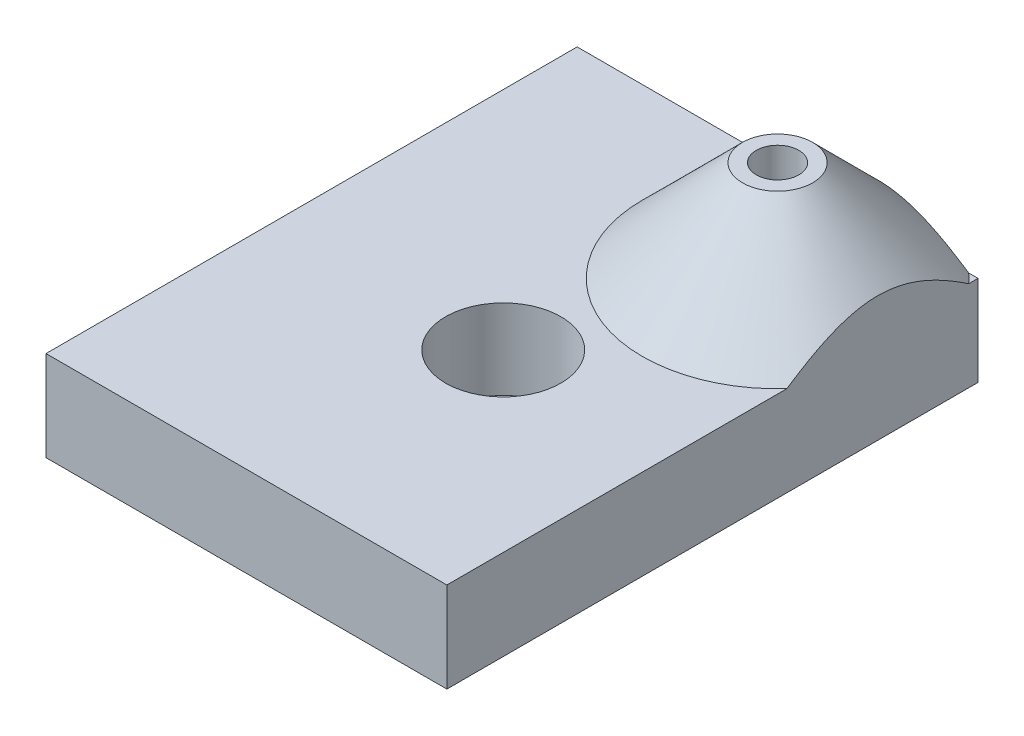
ISO-10303-21;
HEADER;
FILE_DESCRIPTION(('STEP AP214'),'2;1');
FILE_NAME('part.step','',(''),(''),'','','');
FILE_SCHEMA(('AUTOMOTIVE_DESIGN { 1 0 10303 214 1 1 1 1 }'));
ENDSEC;
DATA;
#1=APPLICATION_CONTEXT('core data for automotive mechanical design processes');
#2=APPLICATION_PROTOCOL_DEFINITION('international standard','automotive_design',2000,#1);
#3=PRODUCT_CONTEXT('',#1,'mechanical');
#4=PRODUCT('Part','Part','',(#3));
#5=PRODUCT_RELATED_PRODUCT_CATEGORY('part','',(#4));
#6=PRODUCT_DEFINITION_FORMATION('','',#4);
#7=PRODUCT_DEFINITION_CONTEXT('part definition',#1,'design');
#8=PRODUCT_DEFINITION('design','',#6,#7);
#9=PRODUCT_DEFINITION_SHAPE('','',#8);
#10=(LENGTH_UNIT() NAMED_UNIT(*) SI_UNIT(.MILLI.,.METRE.));
#11=(NAMED_UNIT(*) PLANE_ANGLE_UNIT() SI_UNIT($,.RADIAN.));
#12=(NAMED_UNIT(*) SI_UNIT($,.STERADIAN.) SOLID_ANGLE_UNIT());
#13=UNCERTAINTY_MEASURE_WITH_UNIT(LENGTH_MEASURE(1.E-05),#10,'distance_accuracy_value','');
#14=(GEOMETRIC_REPRESENTATION_CONTEXT(3) GLOBAL_UNCERTAINTY_ASSIGNED_CONTEXT((#13)) GLOBAL_UNIT_ASSIGNED_CONTEXT((#10,
#11,#12)) REPRESENTATION_CONTEXT('',''));
#15=CARTESIAN_POINT('',(0.,0.,0.));
#16=DIRECTION('',(0.,0.,1.));
#17=DIRECTION('',(1.,0.,0.));
#18=AXIS2_PLACEMENT_3D('',#15,#16,#17);
#19=CARTESIAN_POINT('',(9.99999999999999,0.,-19.));
#20=DIRECTION('',(0.,1.,0.));
#21=DIRECTION('',(0.,0.,1.));
#22=AXIS2_PLACEMENT_3D('',#19,#20,#21);
#23=CYLINDRICAL_SURFACE('',#22,2.125);
#24=CARTESIAN_POINT('',(9.99999999999999,19.,-19.));
#25=DIRECTION('',(0.,1.,0.));
#26=DIRECTION('',(0.,0.,1.));
#27=AXIS2_PLACEMENT_3D('',#24,#25,#26);
#28=CIRCLE('',#27,2.125);
#29=CARTESIAN_POINT('',(9.99999999999999,19.,-16.875));
#30=VERTEX_POINT('',#29);
#31=EDGE_CURVE('E41',#30,#30,#28,.T.);
#32=ORIENTED_EDGE('',*,*,#31,.T.);
#33=EDGE_LOOP('',(#32));
#34=FACE_BOUND('',#33,.T.);
#35=CARTESIAN_POINT('',(9.99999999999999,11.,-19.));
#36=DIRECTION('',(0.,-1.,0.));
#37=DIRECTION('',(0.,0.,-1.));
#38=AXIS2_PLACEMENT_3D('',#35,#36,#37);
#39=CIRCLE('',#38,2.125);
#40=CARTESIAN_POINT('',(9.99999999999999,11.,-21.125));
#41=VERTEX_POINT('',#40);
#42=EDGE_CURVE('E144',#41,#41,#39,.F.);
#43=ORIENTED_EDGE('',*,*,#42,.F.);
#44=EDGE_LOOP('',(#43));
#45=FACE_BOUND('',#44,.T.);
#46=ADVANCED_FACE('F36',(#34,#45),#23,.F.);
#47=CARTESIAN_POINT('',(0.,9.,0.));
#48=DIRECTION('',(0.,-1.,0.));
#49=DIRECTION('',(0.,0.,-1.));
#50=AXIS2_PLACEMENT_3D('',#47,#48,#49);
#51=PLANE('',#50);
#52=CARTESIAN_POINT('',(2.5,9.,0.875000000000001));
#53=DIRECTION('',(0.,1.,0.));
#54=DIRECTION('',(0.,0.,1.));
#55=AXIS2_PLACEMENT_3D('',#52,#53,#54);
#56=CIRCLE('',#55,5.75);
#57=CARTESIAN_POINT('',(2.5,9.,6.625));
#58=VERTEX_POINT('',#57);
#59=EDGE_CURVE('E196',#58,#58,#56,.T.);
#60=ORIENTED_EDGE('',*,*,#59,.F.);
#61=EDGE_LOOP('',(#60));
#62=FACE_BOUND('',#61,.T.);
#63=DIRECTION('',(0.,0.,-1.));
#64=VECTOR('',#63,1.);
#65=CARTESIAN_POINT('',(20.,9.,24.));
#66=LINE('',#65,#64);
#67=CARTESIAN_POINT('',(20.,9.,24.));
#68=VERTEX_POINT('',#67);
#69=CARTESIAN_POINT('',(20.,9.,-9.93082142639152));
#70=VERTEX_POINT('',#69);
#71=EDGE_CURVE('E203',#68,#70,#66,.T.);
#72=ORIENTED_EDGE('',*,*,#71,.T.);
#73=CARTESIAN_POINT('',(9.99999999999999,9.,-19.));
#74=DIRECTION('',(0.,-1.,0.));
#75=DIRECTION('',(0.,0.,-1.));
#76=AXIS2_PLACEMENT_3D('',#73,#74,#75);
#77=CIRCLE('',#76,13.5);
#78=CARTESIAN_POINT('',(0.930821426391518,9.,-29.));
#79=VERTEX_POINT('',#78);
#80=EDGE_CURVE('E230',#70,#79,#77,.T.);
#81=ORIENTED_EDGE('',*,*,#80,.T.);
#82=DIRECTION('',(1.,0.,0.));
#83=VECTOR('',#82,1.);
#84=CARTESIAN_POINT('',(20.,9.,-29.));
#85=LINE('',#84,#83);
#86=CARTESIAN_POINT('',(-20.,9.,-29.));
#87=VERTEX_POINT('',#86);
#88=EDGE_CURVE('E191',#87,#79,#85,.T.);
#89=ORIENTED_EDGE('',*,*,#88,.F.);
#90=DIRECTION('',(0.,0.,1.));
#91=VECTOR('',#90,1.);
#92=CARTESIAN_POINT('',(-20.,9.,24.));
#93=LINE('',#92,#91);
#94=CARTESIAN_POINT('',(-20.,9.,24.));
#95=VERTEX_POINT('',#94);
#96=EDGE_CURVE('E206',#87,#95,#93,.T.);
#97=ORIENTED_EDGE('',*,*,#96,.T.);
#98=DIRECTION('',(1.,0.,0.));
#99=VECTOR('',#98,1.);
#100=CARTESIAN_POINT('',(-20.,9.,24.));
#101=LINE('',#100,#99);
#102=EDGE_CURVE('E209',#95,#68,#101,.T.);
#103=ORIENTED_EDGE('',*,*,#102,.T.);
#104=EDGE_LOOP('',(#72,#81,#89,#97,#103));
#105=FACE_BOUND('',#104,.T.);
#106=ADVANCED_FACE('F265',(#62,#105),#51,.F.);
#107=CARTESIAN_POINT('',(2.5,9.,0.875000000000001));
#108=DIRECTION('',(0.,-1.,0.));
#109=DIRECTION('',(0.,0.,-1.));
#110=AXIS2_PLACEMENT_3D('',#107,#108,#109);
#111=CYLINDRICAL_SURFACE('',#110,2.625);
#112=CARTESIAN_POINT('',(2.5,0.,0.875000000000001));
#113=DIRECTION('',(0.,-1.,0.));
#114=DIRECTION('',(0.,0.,-1.));
#115=AXIS2_PLACEMENT_3D('',#112,#113,#114);
#116=CIRCLE('',#115,2.625);
#117=CARTESIAN_POINT('',(2.5,0.,-1.75));
#118=VERTEX_POINT('',#117);
#119=EDGE_CURVE('E215',#118,#118,#116,.T.);
#120=ORIENTED_EDGE('',*,*,#119,.T.);
#121=EDGE_LOOP('',(#120));
#122=FACE_BOUND('',#121,.T.);
#123=CARTESIAN_POINT('',(2.5,0.999999999999999,0.875000000000001));
#124=DIRECTION('',(0.,1.,0.));
#125=DIRECTION('',(0.,0.,1.));
#126=AXIS2_PLACEMENT_3D('',#123,#124,#125);
#127=CIRCLE('',#126,2.625);
#128=CARTESIAN_POINT('',(2.5,0.999999999999999,3.5));
#129=VERTEX_POINT('',#128);
#130=EDGE_CURVE('E200',#129,#129,#127,.F.);
#131=ORIENTED_EDGE('',*,*,#130,.F.);
#132=EDGE_LOOP('',(#131));
#133=FACE_BOUND('',#132,.T.);
#134=ADVANCED_FACE('F261',(#122,#133),#111,.F.);
#135=CARTESIAN_POINT('',(20.,9.,24.));
#136=DIRECTION('',(-1.,0.,0.));
#137=DIRECTION('',(0.,0.,1.));
#138=AXIS2_PLACEMENT_3D('',#135,#136,#137);
#139=PLANE('',#138);
#140=DIRECTION('',(0.,0.,-1.));
#141=VECTOR('',#140,1.);
#142=CARTESIAN_POINT('',(20.,0.,24.));
#143=LINE('',#142,#141);
#144=CARTESIAN_POINT('',(20.,0.,24.));
#145=VERTEX_POINT('',#144);
#146=CARTESIAN_POINT('',(20.,0.,-29.));
#147=VERTEX_POINT('',#146);
#148=EDGE_CURVE('E212',#145,#147,#143,.T.);
#149=ORIENTED_EDGE('',*,*,#148,.T.);
#150=DIRECTION('',(0.,-1.,0.));
#151=VECTOR('',#150,1.);
#152=CARTESIAN_POINT('',(20.,9.,-29.));
#153=LINE('',#152,#151);
#154=CARTESIAN_POINT('',(20.,9.,-29.));
#155=VERTEX_POINT('',#154);
#156=EDGE_CURVE('E181',#155,#147,#153,.T.);
#157=ORIENTED_EDGE('',*,*,#156,.F.);
#158=CARTESIAN_POINT('',(20.,9.,-28.0691785736085));
#159=VERTEX_POINT('',#158);
#160=EDGE_CURVE('E207',#159,#155,#66,.T.);
#161=ORIENTED_EDGE('',*,*,#160,.F.);
#162=CARTESIAN_POINT('',(20.,9.,-28.0691785736085));
#163=CARTESIAN_POINT('',(20.,9.14863084835387,-27.8478908919991));
#164=CARTESIAN_POINT('',(20.,9.29525255157862,-27.6252315931226));
#165=CARTESIAN_POINT('',(20.,9.58373545023814,-27.1767703096996));
#166=CARTESIAN_POINT('',(20.,9.72559537472308,-26.9509675085286));
#167=CARTESIAN_POINT('',(20.,10.0045207458866,-26.4946477844465));
#168=CARTESIAN_POINT('',(20.,10.1415544806194,-26.2641114030119));
#169=CARTESIAN_POINT('',(20.,10.4089602890909,-25.7992213466537));
#170=CARTESIAN_POINT('',(20.,10.5393328167432,-25.5648679332725));
#171=CARTESIAN_POINT('',(20.,10.7961794864899,-25.0845595824855));
#172=CARTESIAN_POINT('',(20.,10.9224053595046,-24.8384707387146));
#173=CARTESIAN_POINT('',(20.,11.1649167487233,-24.3414580702618));
#174=CARTESIAN_POINT('',(20.,11.2812014344582,-24.0905338437821));
#175=CARTESIAN_POINT('',(20.,11.6119178302384,-23.3310273307513));
#176=CARTESIAN_POINT('',(20.,11.8089101911634,-22.8144437435857));
#177=CARTESIAN_POINT('',(20.,12.0668361113626,-21.9885708486855));
#178=CARTESIAN_POINT('',(20.,12.1497860559244,-21.6861199030534));
#179=CARTESIAN_POINT('',(20.,12.2912181191736,-21.0754249449119));
#180=CARTESIAN_POINT('',(20.,12.3496992962277,-20.7671807099359));
#181=CARTESIAN_POINT('',(20.,12.4385916305221,-20.1505581580702));
#182=CARTESIAN_POINT('',(20.,12.4693450906708,-19.842229847095));
#183=CARTESIAN_POINT('',(20.,12.5022515097538,-19.2240453253));
#184=CARTESIAN_POINT('',(20.,12.5044066803216,-18.9141892344841));
#185=CARTESIAN_POINT('',(20.,12.4799802452925,-18.2953888249321));
#186=CARTESIAN_POINT('',(20.,12.4533761256364,-17.9864454106584));
#187=CARTESIAN_POINT('',(20.,12.3729517732879,-17.3721447267612));
#188=CARTESIAN_POINT('',(20.,12.3191282919773,-17.0667878896461));
#189=CARTESIAN_POINT('',(20.,12.1862407483604,-16.4577329756965));
#190=CARTESIAN_POINT('',(20.,12.1068728336878,-16.1541020894245));
#191=CARTESIAN_POINT('',(20.,11.9265941668349,-15.5534019014748));
#192=CARTESIAN_POINT('',(20.,11.8256835668444,-15.256332553459));
#193=CARTESIAN_POINT('',(20.,11.5458349053206,-14.5087758393405));
#194=CARTESIAN_POINT('',(20.,11.3543608701864,-14.0629980201337));
#195=CARTESIAN_POINT('',(20.,10.9393082952592,-13.1863061587611));
#196=CARTESIAN_POINT('',(20.,10.7156903823607,-12.7554111613889));
#197=CARTESIAN_POINT('',(20.,10.3660494862257,-12.1252694639393));
#198=CARTESIAN_POINT('',(20.,10.2490326409227,-11.9209416304578));
#199=CARTESIAN_POINT('',(20.,10.0101475768857,-11.5151247148084));
#200=CARTESIAN_POINT('',(20.,9.88827915427424,-11.3136357524208));
#201=CARTESIAN_POINT('',(20.,9.6407403246418,-10.9138930126254));
#202=CARTESIAN_POINT('',(20.,9.51508308183893,-10.7156310528153));
#203=CARTESIAN_POINT('',(20.,9.26013919296424,-10.3214987071067));
#204=CARTESIAN_POINT('',(20.,9.13085314683506,-10.1256279334727));
#205=CARTESIAN_POINT('',(20.,9.,-9.93082142639152));
#206=B_SPLINE_CURVE_WITH_KNOTS('',3,(#162,#163,#164,#165,#166,#167,#168,#169,#170,#171,#172,
#173,#174,#175,#176,#177,#178,#179,#180,#181,#182,#183,#184,#185,#186,#187,#188,#189,#190,#191,
#192,#193,#194,#195,#196,#197,#198,#199,#200,#201,#202,#203,#204,#205),.UNSPECIFIED.,.F.,.F.,(4,
2,2,2,2,2,2,2,2,2,2,2,2,2,2,2,2,2,2,2,2,4),(0.,0.799724862764027,1.59966150695302,
2.40412962083734,3.20854284267163,4.03803567830211,4.8675977407129,6.52239282059448,
7.46243693397798,8.40251721981851,9.33082652710345,10.2590640436616,11.1880287526683,
12.1171043593611,13.0576672798055,13.9982235557987,15.4518536969714,16.9072798104762,
17.6136171466269,18.3199841965056,19.0241294787153,19.7281590238874),.UNSPECIFIED.);
#207=EDGE_CURVE('E11',#159,#70,#206,.T.);
#208=ORIENTED_EDGE('',*,*,#207,.T.);
#209=ORIENTED_EDGE('',*,*,#71,.F.);
#210=DIRECTION('',(0.,-1.,0.));
#211=VECTOR('',#210,1.);
#212=CARTESIAN_POINT('',(20.,9.,24.));
#213=LINE('',#212,#211);
#214=EDGE_CURVE('E211',#68,#145,#213,.T.);
#215=ORIENTED_EDGE('',*,*,#214,.T.);
#216=EDGE_LOOP('',(#149,#157,#161,#208,#209,#215));
#217=FACE_BOUND('',#216,.T.);
#218=ADVANCED_FACE('F264',(#217),#139,.F.);
#219=CARTESIAN_POINT('',(-20.,9.,24.));
#220=DIRECTION('',(1.,0.,0.));
#221=DIRECTION('',(0.,0.,-1.));
#222=AXIS2_PLACEMENT_3D('',#219,#220,#221);
#223=PLANE('',#222);
#224=DIRECTION('',(0.,0.,1.));
#225=VECTOR('',#224,1.);
#226=CARTESIAN_POINT('',(-20.,0.,24.));
#227=LINE('',#226,#225);
#228=CARTESIAN_POINT('',(-20.,0.,-29.));
#229=VERTEX_POINT('',#228);
#230=CARTESIAN_POINT('',(-20.,0.,24.));
#231=VERTEX_POINT('',#230);
#232=EDGE_CURVE('E214',#229,#231,#227,.T.);
#233=ORIENTED_EDGE('',*,*,#232,.T.);
#234=DIRECTION('',(0.,-1.,0.));
#235=VECTOR('',#234,1.);
#236=CARTESIAN_POINT('',(-20.,9.,24.));
#237=LINE('',#236,#235);
#238=EDGE_CURVE('E221',#95,#231,#237,.T.);
#239=ORIENTED_EDGE('',*,*,#238,.F.);
#240=ORIENTED_EDGE('',*,*,#96,.F.);
#241=DIRECTION('',(0.,1.,0.));
#242=VECTOR('',#241,1.);
#243=CARTESIAN_POINT('',(-20.,9.,-29.));
#244=LINE('',#243,#242);
#245=EDGE_CURVE('E187',#229,#87,#244,.T.);
#246=ORIENTED_EDGE('',*,*,#245,.F.);
#247=EDGE_LOOP('',(#233,#239,#240,#246));
#248=FACE_BOUND('',#247,.T.);
#249=ADVANCED_FACE('F277',(#248),#223,.F.);
#250=CARTESIAN_POINT('',(-20.,9.,24.));
#251=DIRECTION('',(0.,0.,-1.));
#252=DIRECTION('',(-1.,0.,0.));
#253=AXIS2_PLACEMENT_3D('',#250,#251,#252);
#254=PLANE('',#253);
#255=DIRECTION('',(1.,0.,0.));
#256=VECTOR('',#255,1.);
#257=CARTESIAN_POINT('',(-20.,0.,24.));
#258=LINE('',#257,#256);
#259=EDGE_CURVE('E217',#231,#145,#258,.T.);
#260=ORIENTED_EDGE('',*,*,#259,.T.);
#261=ORIENTED_EDGE('',*,*,#214,.F.);
#262=ORIENTED_EDGE('',*,*,#102,.F.);
#263=ORIENTED_EDGE('',*,*,#238,.T.);
#264=EDGE_LOOP('',(#260,#261,#262,#263));
#265=FACE_BOUND('',#264,.T.);
#266=ADVANCED_FACE('F270',(#265),#254,.F.);
#267=CARTESIAN_POINT('',(19.0691785736085,9.,-29.));
#268=VERTEX_POINT('',#267);
#269=EDGE_CURVE('E190',#268,#155,#85,.T.);
#270=ORIENTED_EDGE('',*,*,#269,.F.);
#271=CARTESIAN_POINT('',(9.99999999999999,9.,-19.));
#272=DIRECTION('',(0.,-1.,0.));
#273=DIRECTION('',(0.,0.,-1.));
#274=AXIS2_PLACEMENT_3D('',#271,#272,#273);
#275=CIRCLE('',#274,13.5);
#276=EDGE_CURVE('E224',#268,#159,#275,.T.);
#277=ORIENTED_EDGE('',*,*,#276,.T.);
#278=ORIENTED_EDGE('',*,*,#160,.T.);
#279=EDGE_LOOP('',(#270,#277,#278));
#280=FACE_BOUND('',#279,.T.);
#281=ADVANCED_FACE('F267',(#280),#51,.F.);
#282=CARTESIAN_POINT('',(0.,0.,0.));
#283=DIRECTION('',(0.,-1.,0.));
#284=DIRECTION('',(0.,0.,-1.));
#285=AXIS2_PLACEMENT_3D('',#282,#283,#284);
#286=PLANE('',#285);
#287=DIRECTION('',(1.,0.,0.));
#288=VECTOR('',#287,1.);
#289=CARTESIAN_POINT('',(0.,0.,-22.625));
#290=LINE('',#289,#288);
#291=CARTESIAN_POINT('',(7.625,0.,-22.625));
#292=VERTEX_POINT('',#291);
#293=CARTESIAN_POINT('',(12.375,0.,-22.625));
#294=VERTEX_POINT('',#293);
#295=EDGE_CURVE('E53',#292,#294,#290,.T.);
#296=ORIENTED_EDGE('',*,*,#295,.F.);
#297=DIRECTION('',(-0.500000000000004,0.,0.866025403784436));
#298=VECTOR('',#297,1.);
#299=CARTESIAN_POINT('',(-4.07816238031155,0.,-2.3545281480719));
#300=LINE('',#299,#298);
#301=CARTESIAN_POINT('',(5.53210527418758,0.,-19.));
#302=VERTEX_POINT('',#301);
#303=EDGE_CURVE('E147',#292,#302,#300,.T.);
#304=ORIENTED_EDGE('',*,*,#303,.T.);
#305=DIRECTION('',(-0.500000000000004,0.,-0.866025403784436));
#306=VECTOR('',#305,1.);
#307=CARTESIAN_POINT('',(12.3763202915929,0.,-7.14547185192825));
#308=LINE('',#307,#306);
#309=CARTESIAN_POINT('',(7.625,0.,-15.375));
#310=VERTEX_POINT('',#309);
#311=EDGE_CURVE('E166',#310,#302,#308,.T.);
#312=ORIENTED_EDGE('',*,*,#311,.F.);
#313=DIRECTION('',(1.,0.,0.));
#314=VECTOR('',#313,1.);
#315=CARTESIAN_POINT('',(0.,0.,-15.375));
#316=LINE('',#315,#314);
#317=CARTESIAN_POINT('',(12.375,0.,-15.375));
#318=VERTEX_POINT('',#317);
#319=EDGE_CURVE('E163',#310,#318,#316,.T.);
#320=ORIENTED_EDGE('',*,*,#319,.T.);
#321=DIRECTION('',(0.499999999999998,0.,-0.86602540378444));
#322=VECTOR('',#321,1.);
#323=CARTESIAN_POINT('',(2.62367970840717,0.,1.51478218591623));
#324=LINE('',#323,#322);
#325=CARTESIAN_POINT('',(14.4678947258124,0.,-19.));
#326=VERTEX_POINT('',#325);
#327=EDGE_CURVE('E160',#318,#326,#324,.T.);
#328=ORIENTED_EDGE('',*,*,#327,.T.);
#329=DIRECTION('',(-0.499999999999998,0.,-0.86602540378444));
#330=VECTOR('',#329,1.);
#331=CARTESIAN_POINT('',(19.0781623803115,0.,-11.0147821859162));
#332=LINE('',#331,#330);
#333=EDGE_CURVE('E158',#326,#294,#332,.T.);
#334=ORIENTED_EDGE('',*,*,#333,.T.);
#335=EDGE_LOOP('',(#296,#304,#312,#320,#328,#334));
#336=FACE_BOUND('',#335,.T.);
#337=ORIENTED_EDGE('',*,*,#119,.F.);
#338=EDGE_LOOP('',(#337));
#339=FACE_BOUND('',#338,.T.);
#340=ORIENTED_EDGE('',*,*,#148,.F.);
#341=ORIENTED_EDGE('',*,*,#259,.F.);
#342=ORIENTED_EDGE('',*,*,#232,.F.);
#343=DIRECTION('',(-1.,0.,0.));
#344=VECTOR('',#343,1.);
#345=CARTESIAN_POINT('',(20.,0.,-29.));
#346=LINE('',#345,#344);
#347=EDGE_CURVE('E184',#147,#229,#346,.T.);
#348=ORIENTED_EDGE('',*,*,#347,.F.);
#349=EDGE_LOOP('',(#340,#341,#342,#348));
#350=FACE_BOUND('',#349,.T.);
#351=ADVANCED_FACE('F256',(#336,#339,#350),#286,.T.);
#352=CARTESIAN_POINT('',(2.5,0.999999999999999,0.875000000000001));
#353=DIRECTION('',(0.,1.,0.));
#354=DIRECTION('',(0.,0.,1.));
#355=AXIS2_PLACEMENT_3D('',#352,#353,#354);
#356=PLANE('',#355);
#357=CARTESIAN_POINT('',(2.5,0.999999999999999,0.875000000000001));
#358=DIRECTION('',(0.,1.,0.));
#359=DIRECTION('',(0.,0.,1.));
#360=AXIS2_PLACEMENT_3D('',#357,#358,#359);
#361=CIRCLE('',#360,5.75);
#362=CARTESIAN_POINT('',(2.5,0.999999999999999,6.625));
#363=VERTEX_POINT('',#362);
#364=EDGE_CURVE('E197',#363,#363,#361,.T.);
#365=ORIENTED_EDGE('',*,*,#364,.T.);
#366=EDGE_LOOP('',(#365));
#367=FACE_BOUND('',#366,.T.);
#368=ORIENTED_EDGE('',*,*,#130,.T.);
#369=EDGE_LOOP('',(#368));
#370=FACE_BOUND('',#369,.T.);
#371=ADVANCED_FACE('F253',(#367,#370),#356,.T.);
#372=CARTESIAN_POINT('',(2.5,0.999999999999999,0.875000000000001));
#373=DIRECTION('',(0.,1.,0.));
#374=DIRECTION('',(0.,0.,1.));
#375=AXIS2_PLACEMENT_3D('',#372,#373,#374);
#376=CYLINDRICAL_SURFACE('',#375,5.75);
#377=ORIENTED_EDGE('',*,*,#364,.F.);
#378=EDGE_LOOP('',(#377));
#379=FACE_BOUND('',#378,.T.);
#380=ORIENTED_EDGE('',*,*,#59,.T.);
#381=EDGE_LOOP('',(#380));
#382=FACE_BOUND('',#381,.T.);
#383=ADVANCED_FACE('F251',(#379,#382),#376,.F.);
#384=CARTESIAN_POINT('',(9.99999999999999,19.,-19.));
#385=DIRECTION('',(0.,1.,0.));
#386=DIRECTION('',(0.,0.,1.));
#387=AXIS2_PLACEMENT_3D('',#384,#385,#386);
#388=PLANE('',#387);
#389=ORIENTED_EDGE('',*,*,#31,.F.);
#390=EDGE_LOOP('',(#389));
#391=FACE_BOUND('',#390,.T.);
#392=CARTESIAN_POINT('',(9.99999999999999,19.,-19.));
#393=DIRECTION('',(0.,1.,0.));
#394=DIRECTION('',(0.,0.,1.));
#395=AXIS2_PLACEMENT_3D('',#392,#393,#394);
#396=CIRCLE('',#395,3.5);
#397=CARTESIAN_POINT('',(9.99999999999999,19.,-15.5));
#398=VERTEX_POINT('',#397);
#399=EDGE_CURVE('E193',#398,#398,#396,.T.);
#400=ORIENTED_EDGE('',*,*,#399,.T.);
#401=EDGE_LOOP('',(#400));
#402=FACE_BOUND('',#401,.T.);
#403=ADVANCED_FACE('F247',(#391,#402),#388,.T.);
#404=CARTESIAN_POINT('',(0.,0.,-29.));
#405=DIRECTION('',(0.,0.,-1.));
#406=DIRECTION('',(-1.,0.,0.));
#407=AXIS2_PLACEMENT_3D('',#404,#405,#406);
#408=PLANE('',#407);
#409=ORIENTED_EDGE('',*,*,#156,.T.);
#410=ORIENTED_EDGE('',*,*,#347,.T.);
#411=ORIENTED_EDGE('',*,*,#245,.T.);
#412=ORIENTED_EDGE('',*,*,#88,.T.);
#413=CARTESIAN_POINT('',(0.930821426391518,9.,-29.));
#414=CARTESIAN_POINT('',(1.15210910800087,9.14863084835387,-29.));
#415=CARTESIAN_POINT('',(1.3747684068774,9.29525255157862,-29.));
#416=CARTESIAN_POINT('',(1.82322969030041,9.58373545023814,-29.));
#417=CARTESIAN_POINT('',(2.04903249147141,9.72559537472308,-29.));
#418=CARTESIAN_POINT('',(2.50535221555354,10.0045207458866,-29.));
#419=CARTESIAN_POINT('',(2.73588859698811,10.1415544806194,-29.));
#420=CARTESIAN_POINT('',(3.20077865334632,10.4089602890909,-29.));
#421=CARTESIAN_POINT('',(3.43513206672753,10.5393328167432,-29.));
#422=CARTESIAN_POINT('',(3.91544041751452,10.7961794864899,-29.));
#423=CARTESIAN_POINT('',(4.16152926128538,10.9224053595046,-29.));
#424=CARTESIAN_POINT('',(4.65854192973815,11.1649167487233,-29.));
#425=CARTESIAN_POINT('',(4.90946615621787,11.2812014344582,-29.));
#426=CARTESIAN_POINT('',(5.66897266924869,11.6119178302384,-29.));
#427=CARTESIAN_POINT('',(6.18555625641429,11.8089101911634,-29.));
#428=CARTESIAN_POINT('',(7.01142915131448,12.0668361113626,-29.));
#429=CARTESIAN_POINT('',(7.31388009694658,12.1497860559244,-29.));
#430=CARTESIAN_POINT('',(7.92457505508808,12.2912181191736,-29.));
#431=CARTESIAN_POINT('',(8.23281929006414,12.3496992962277,-29.));
#432=CARTESIAN_POINT('',(8.8494418419298,12.4385916305221,-29.));
#433=CARTESIAN_POINT('',(9.15777015290497,12.4693450906708,-29.));
#434=CARTESIAN_POINT('',(9.77595467470002,12.5022515097538,-29.));
#435=CARTESIAN_POINT('',(10.0858107655159,12.5044066803216,-29.));
#436=CARTESIAN_POINT('',(10.7046111750679,12.4799802452925,-29.));
#437=CARTESIAN_POINT('',(11.0135545893416,12.4533761256364,-29.));
#438=CARTESIAN_POINT('',(11.6278552732388,12.3729517732879,-29.));
#439=CARTESIAN_POINT('',(11.9332121103539,12.3191282919773,-29.));
#440=CARTESIAN_POINT('',(12.5422670243035,12.1862407483604,-29.));
#441=CARTESIAN_POINT('',(12.8458979105755,12.1068728336878,-29.));
#442=CARTESIAN_POINT('',(13.4465980985252,11.9265941668349,-29.));
#443=CARTESIAN_POINT('',(13.743667446541,11.8256835668444,-29.));
#444=CARTESIAN_POINT('',(14.4912241606595,11.5458349053206,-29.));
#445=CARTESIAN_POINT('',(14.9370019798663,11.3543608701864,-29.));
#446=CARTESIAN_POINT('',(15.8136938412389,10.9393082952592,-29.));
#447=CARTESIAN_POINT('',(16.2445888386111,10.7156903823607,-29.));
#448=CARTESIAN_POINT('',(16.8747305360607,10.3660494862257,-29.));
#449=CARTESIAN_POINT('',(17.0790583695422,10.2490326409227,-29.));
#450=CARTESIAN_POINT('',(17.4848752851916,10.0101475768857,-29.));
#451=CARTESIAN_POINT('',(17.6863642475792,9.88827915427424,-29.));
#452=CARTESIAN_POINT('',(18.0861069873746,9.6407403246418,-29.));
#453=CARTESIAN_POINT('',(18.2843689471847,9.51508308183893,-29.));
#454=CARTESIAN_POINT('',(18.6785012928933,9.26013919296424,-29.));
#455=CARTESIAN_POINT('',(18.8743720665273,9.13085314683506,-29.));
#456=CARTESIAN_POINT('',(19.0691785736085,9.,-29.));
#457=B_SPLINE_CURVE_WITH_KNOTS('',3,(#413,#414,#415,#416,#417,#418,#419,#420,#421,#422,#423,
#424,#425,#426,#427,#428,#429,#430,#431,#432,#433,#434,#435,#436,#437,#438,#439,#440,#441,#442,
#443,#444,#445,#446,#447,#448,#449,#450,#451,#452,#453,#454,#455,#456),.UNSPECIFIED.,.F.,.F.,(4,
2,2,2,2,2,2,2,2,2,2,2,2,2,2,2,2,2,2,2,2,4),(0.,0.799724862764028,1.59966150695302,
2.40412962083734,3.20854284267163,4.03803567830211,4.86759774071289,6.52239282059447,
7.46243693397798,8.40251721981851,9.33082652710345,10.2590640436616,11.1880287526683,
12.1171043593611,13.0576672798055,13.9982235557987,15.4518536969713,16.9072798104762,
17.6136171466269,18.3199841965056,19.0241294787153,19.7281590238874),.UNSPECIFIED.);
#458=EDGE_CURVE('E46',#79,#268,#457,.T.);
#459=ORIENTED_EDGE('',*,*,#458,.T.);
#460=ORIENTED_EDGE('',*,*,#269,.T.);
#461=EDGE_LOOP('',(#409,#410,#411,#412,#459,#460));
#462=FACE_BOUND('',#461,.T.);
#463=ADVANCED_FACE('F242',(#462),#408,.T.);
#464=CARTESIAN_POINT('',(9.99999999999999,19.0000000000001,-19.));
#465=DIRECTION('',(0.,-1.,0.));
#466=DIRECTION('',(0.,0.,-1.));
#467=AXIS2_PLACEMENT_3D('',#464,#465,#466);
#468=CONICAL_SURFACE('',#467,3.5,0.785398163397443);
#469=ORIENTED_EDGE('',*,*,#458,.F.);
#470=ORIENTED_EDGE('',*,*,#80,.F.);
#471=ORIENTED_EDGE('',*,*,#207,.F.);
#472=ORIENTED_EDGE('',*,*,#276,.F.);
#473=EDGE_LOOP('',(#469,#470,#471,#472));
#474=FACE_BOUND('',#473,.T.);
#475=ORIENTED_EDGE('',*,*,#399,.F.);
#476=EDGE_LOOP('',(#475));
#477=FACE_BOUND('',#476,.T.);
#478=ADVANCED_FACE('F38',(#474,#477),#468,.T.);
#479=CARTESIAN_POINT('',(0.,11.,-22.625));
#480=DIRECTION('',(0.,0.,-1.));
#481=DIRECTION('',(-1.,0.,0.));
#482=AXIS2_PLACEMENT_3D('',#479,#480,#481);
#483=PLANE('',#482);
#484=ORIENTED_EDGE('',*,*,#295,.T.);
#485=DIRECTION('',(0.,-1.,0.));
#486=VECTOR('',#485,1.);
#487=CARTESIAN_POINT('',(12.375,11.,-22.625));
#488=LINE('',#487,#486);
#489=CARTESIAN_POINT('',(12.375,11.,-22.625));
#490=VERTEX_POINT('',#489);
#491=EDGE_CURVE('E127',#490,#294,#488,.T.);
#492=ORIENTED_EDGE('',*,*,#491,.F.);
#493=DIRECTION('',(1.,0.,0.));
#494=VECTOR('',#493,1.);
#495=CARTESIAN_POINT('',(0.,11.,-22.625));
#496=LINE('',#495,#494);
#497=CARTESIAN_POINT('',(7.625,11.,-22.625));
#498=VERTEX_POINT('',#497);
#499=EDGE_CURVE('E135',#498,#490,#496,.T.);
#500=ORIENTED_EDGE('',*,*,#499,.F.);
#501=DIRECTION('',(0.,-1.,0.));
#502=VECTOR('',#501,1.);
#503=CARTESIAN_POINT('',(7.625,11.,-22.625));
#504=LINE('',#503,#502);
#505=EDGE_CURVE('E171',#498,#292,#504,.T.);
#506=ORIENTED_EDGE('',*,*,#505,.T.);
#507=EDGE_LOOP('',(#484,#492,#500,#506));
#508=FACE_BOUND('',#507,.T.);
#509=ADVANCED_FACE('F138',(#508),#483,.F.);
#510=CARTESIAN_POINT('',(-4.07816238031155,11.,-2.3545281480719));
#511=DIRECTION('',(0.866025403784436,0.,0.500000000000004));
#512=DIRECTION('',(0.500000000000004,0.,-0.866025403784436));
#513=AXIS2_PLACEMENT_3D('',#510,#511,#512);
#514=PLANE('',#513);
#515=ORIENTED_EDGE('',*,*,#303,.F.);
#516=ORIENTED_EDGE('',*,*,#505,.F.);
#517=DIRECTION('',(-0.500000000000004,0.,0.866025403784436));
#518=VECTOR('',#517,1.);
#519=CARTESIAN_POINT('',(-4.07816238031155,11.,-2.3545281480719));
#520=LINE('',#519,#518);
#521=CARTESIAN_POINT('',(5.53210527418758,11.,-19.));
#522=VERTEX_POINT('',#521);
#523=EDGE_CURVE('E139',#498,#522,#520,.T.);
#524=ORIENTED_EDGE('',*,*,#523,.T.);
#525=DIRECTION('',(0.,-1.,0.));
#526=VECTOR('',#525,1.);
#527=CARTESIAN_POINT('',(5.53210527418758,11.,-19.));
#528=LINE('',#527,#526);
#529=EDGE_CURVE('E173',#522,#302,#528,.T.);
#530=ORIENTED_EDGE('',*,*,#529,.T.);
#531=EDGE_LOOP('',(#515,#516,#524,#530));
#532=FACE_BOUND('',#531,.T.);
#533=ADVANCED_FACE('F305',(#532),#514,.T.);
#534=CARTESIAN_POINT('',(12.3763202915929,11.,-7.14547185192825));
#535=DIRECTION('',(-0.866025403784436,0.,0.500000000000004));
#536=DIRECTION('',(0.500000000000004,0.,0.866025403784436));
#537=AXIS2_PLACEMENT_3D('',#534,#535,#536);
#538=PLANE('',#537);
#539=ORIENTED_EDGE('',*,*,#311,.T.);
#540=ORIENTED_EDGE('',*,*,#529,.F.);
#541=DIRECTION('',(-0.500000000000004,0.,-0.866025403784436));
#542=VECTOR('',#541,1.);
#543=CARTESIAN_POINT('',(12.3763202915929,11.,-7.14547185192825));
#544=LINE('',#543,#542);
#545=CARTESIAN_POINT('',(7.625,11.,-15.375));
#546=VERTEX_POINT('',#545);
#547=EDGE_CURVE('E154',#546,#522,#544,.T.);
#548=ORIENTED_EDGE('',*,*,#547,.F.);
#549=DIRECTION('',(0.,-1.,0.));
#550=VECTOR('',#549,1.);
#551=CARTESIAN_POINT('',(7.625,11.,-15.375));
#552=LINE('',#551,#550);
#553=EDGE_CURVE('E175',#546,#310,#552,.T.);
#554=ORIENTED_EDGE('',*,*,#553,.T.);
#555=EDGE_LOOP('',(#539,#540,#548,#554));
#556=FACE_BOUND('',#555,.T.);
#557=ADVANCED_FACE('F308',(#556),#538,.F.);
#558=CARTESIAN_POINT('',(0.,11.,-15.375));
#559=DIRECTION('',(0.,0.,-1.));
#560=DIRECTION('',(-1.,0.,0.));
#561=AXIS2_PLACEMENT_3D('',#558,#559,#560);
#562=PLANE('',#561);
#563=ORIENTED_EDGE('',*,*,#319,.F.);
#564=ORIENTED_EDGE('',*,*,#553,.F.);
#565=DIRECTION('',(1.,0.,0.));
#566=VECTOR('',#565,1.);
#567=CARTESIAN_POINT('',(0.,11.,-15.375));
#568=LINE('',#567,#566);
#569=CARTESIAN_POINT('',(12.375,11.,-15.375));
#570=VERTEX_POINT('',#569);
#571=EDGE_CURVE('E151',#546,#570,#568,.T.);
#572=ORIENTED_EDGE('',*,*,#571,.T.);
#573=DIRECTION('',(0.,-1.,0.));
#574=VECTOR('',#573,1.);
#575=CARTESIAN_POINT('',(12.375,11.,-15.375));
#576=LINE('',#575,#574);
#577=EDGE_CURVE('E177',#570,#318,#576,.T.);
#578=ORIENTED_EDGE('',*,*,#577,.T.);
#579=EDGE_LOOP('',(#563,#564,#572,#578));
#580=FACE_BOUND('',#579,.T.);
#581=ADVANCED_FACE('F312',(#580),#562,.T.);
#582=CARTESIAN_POINT('',(2.62367970840717,11.,1.51478218591623));
#583=DIRECTION('',(-0.86602540378444,0.,-0.499999999999998));
#584=DIRECTION('',(-0.499999999999998,0.,0.86602540378444));
#585=AXIS2_PLACEMENT_3D('',#582,#583,#584);
#586=PLANE('',#585);
#587=ORIENTED_EDGE('',*,*,#327,.F.);
#588=ORIENTED_EDGE('',*,*,#577,.F.);
#589=DIRECTION('',(0.499999999999998,0.,-0.86602540378444));
#590=VECTOR('',#589,1.);
#591=CARTESIAN_POINT('',(2.62367970840717,11.,1.51478218591623));
#592=LINE('',#591,#590);
#593=CARTESIAN_POINT('',(14.4678947258124,11.,-19.));
#594=VERTEX_POINT('',#593);
#595=EDGE_CURVE('E134',#570,#594,#592,.T.);
#596=ORIENTED_EDGE('',*,*,#595,.T.);
#597=DIRECTION('',(0.,-1.,0.));
#598=VECTOR('',#597,1.);
#599=CARTESIAN_POINT('',(14.4678947258124,11.,-19.));
#600=LINE('',#599,#598);
#601=EDGE_CURVE('E130',#594,#326,#600,.T.);
#602=ORIENTED_EDGE('',*,*,#601,.T.);
#603=EDGE_LOOP('',(#587,#588,#596,#602));
#604=FACE_BOUND('',#603,.T.);
#605=ADVANCED_FACE('F302',(#604),#586,.T.);
#606=CARTESIAN_POINT('',(19.0781623803115,11.,-11.0147821859162));
#607=DIRECTION('',(-0.86602540378444,0.,0.499999999999998));
#608=DIRECTION('',(0.499999999999998,0.,0.86602540378444));
#609=AXIS2_PLACEMENT_3D('',#606,#607,#608);
#610=PLANE('',#609);
#611=ORIENTED_EDGE('',*,*,#333,.F.);
#612=ORIENTED_EDGE('',*,*,#601,.F.);
#613=DIRECTION('',(-0.499999999999998,0.,-0.86602540378444));
#614=VECTOR('',#613,1.);
#615=CARTESIAN_POINT('',(19.0781623803115,11.,-11.0147821859162));
#616=LINE('',#615,#614);
#617=EDGE_CURVE('E125',#594,#490,#616,.T.);
#618=ORIENTED_EDGE('',*,*,#617,.T.);
#619=ORIENTED_EDGE('',*,*,#491,.T.);
#620=EDGE_LOOP('',(#611,#612,#618,#619));
#621=FACE_BOUND('',#620,.T.);
#622=ADVANCED_FACE('F126',(#621),#610,.T.);
#623=CARTESIAN_POINT('',(0.,11.,0.));
#624=DIRECTION('',(0.,-1.,0.));
#625=DIRECTION('',(0.,0.,-1.));
#626=AXIS2_PLACEMENT_3D('',#623,#624,#625);
#627=PLANE('',#626);
#628=ORIENTED_EDGE('',*,*,#42,.T.);
#629=EDGE_LOOP('',(#628));
#630=FACE_BOUND('',#629,.T.);
#631=ORIENTED_EDGE('',*,*,#499,.T.);
#632=ORIENTED_EDGE('',*,*,#617,.F.);
#633=ORIENTED_EDGE('',*,*,#595,.F.);
#634=ORIENTED_EDGE('',*,*,#571,.F.);
#635=ORIENTED_EDGE('',*,*,#547,.T.);
#636=ORIENTED_EDGE('',*,*,#523,.F.);
#637=EDGE_LOOP('',(#631,#632,#633,#634,#635,#636));
#638=FACE_BOUND('',#637,.T.);
#639=ADVANCED_FACE('F142',(#630,#638),#627,.T.);
#640=CLOSED_SHELL('',(#46,#106,#134,#218,#249,#266,#281,#351,#371,#383,#403,#463,#478,#509,#533,
#557,#581,#605,#622,#639));
#641=MANIFOLD_SOLID_BREP('B2',#640);
#642=ADVANCED_BREP_SHAPE_REPRESENTATION('',(#18,#641),#14);
#643=SHAPE_DEFINITION_REPRESENTATION(#9,#642);
ENDSEC;
END-ISO-10303-21;
